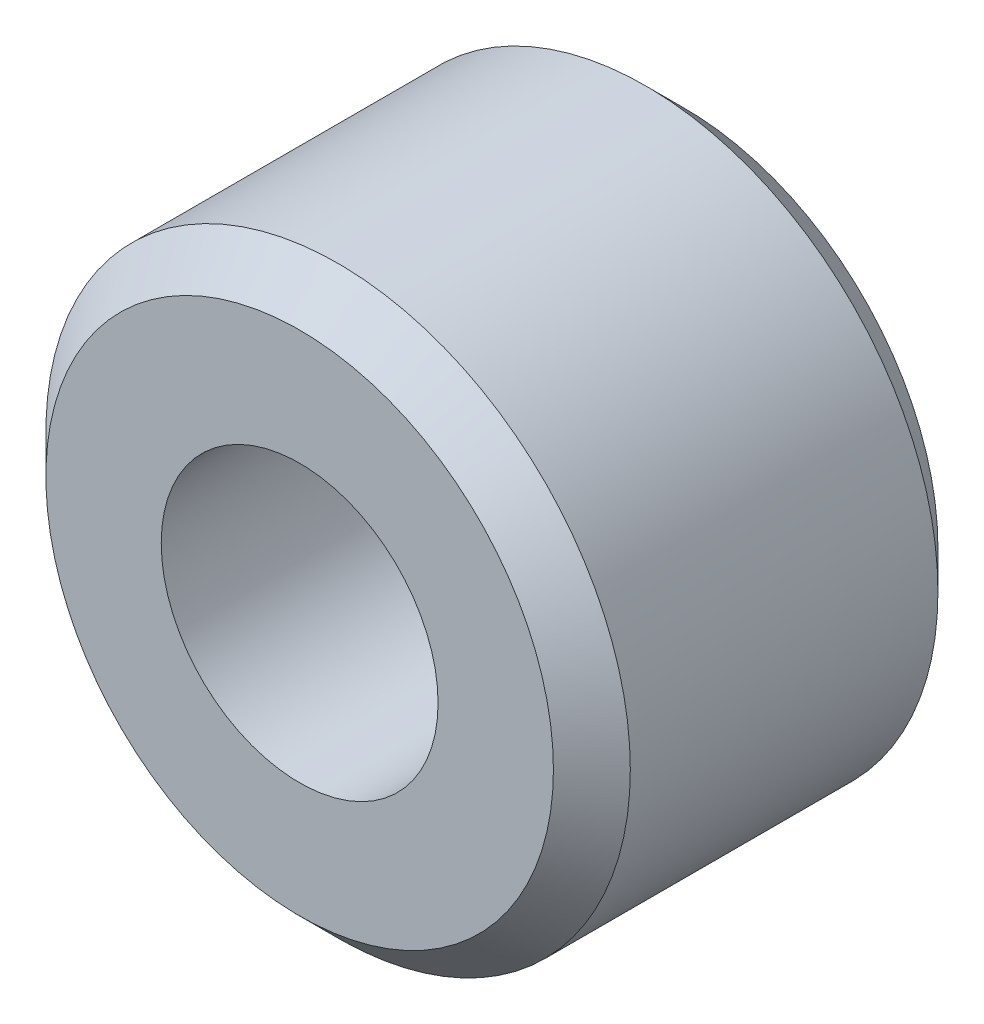
ISO-10303-21;
HEADER;
FILE_DESCRIPTION(('STEP AP214'),'2;1');
FILE_NAME('part.step','',(''),(''),'','','');
FILE_SCHEMA(('AUTOMOTIVE_DESIGN { 1 0 10303 214 1 1 1 1 }'));
ENDSEC;
DATA;
#1=APPLICATION_CONTEXT('core data for automotive mechanical design processes');
#2=APPLICATION_PROTOCOL_DEFINITION('international standard','automotive_design',2000,#1);
#3=PRODUCT_CONTEXT('',#1,'mechanical');
#4=PRODUCT('Part','Part','',(#3));
#5=PRODUCT_RELATED_PRODUCT_CATEGORY('part','',(#4));
#6=PRODUCT_DEFINITION_FORMATION('','',#4);
#7=PRODUCT_DEFINITION_CONTEXT('part definition',#1,'design');
#8=PRODUCT_DEFINITION('design','',#6,#7);
#9=PRODUCT_DEFINITION_SHAPE('','',#8);
#10=(LENGTH_UNIT() NAMED_UNIT(*) SI_UNIT(.MILLI.,.METRE.));
#11=(NAMED_UNIT(*) PLANE_ANGLE_UNIT() SI_UNIT($,.RADIAN.));
#12=(NAMED_UNIT(*) SI_UNIT($,.STERADIAN.) SOLID_ANGLE_UNIT());
#13=UNCERTAINTY_MEASURE_WITH_UNIT(LENGTH_MEASURE(1.E-05),#10,'distance_accuracy_value','');
#14=(GEOMETRIC_REPRESENTATION_CONTEXT(3) GLOBAL_UNCERTAINTY_ASSIGNED_CONTEXT((#13)) GLOBAL_UNIT_ASSIGNED_CONTEXT((#10,
#11,#12)) REPRESENTATION_CONTEXT('',''));
#15=CARTESIAN_POINT('',(0.,0.,0.));
#16=DIRECTION('',(0.,0.,1.));
#17=DIRECTION('',(1.,0.,0.));
#18=AXIS2_PLACEMENT_3D('',#15,#16,#17);
#19=CARTESIAN_POINT('',(0.,0.,5.));
#20=DIRECTION('',(0.,0.,1.));
#21=DIRECTION('',(1.,0.,0.));
#22=AXIS2_PLACEMENT_3D('',#19,#20,#21);
#23=PLANE('',#22);
#24=CARTESIAN_POINT('',(0.,0.,5.));
#25=DIRECTION('',(0.,0.,1.));
#26=DIRECTION('',(1.,0.,0.));
#27=AXIS2_PLACEMENT_3D('',#24,#25,#26);
#28=CIRCLE('',#27,3.3);
#29=CARTESIAN_POINT('',(3.3,0.,5.));
#30=VERTEX_POINT('',#29);
#31=EDGE_CURVE('E10',#30,#30,#28,.T.);
#32=ORIENTED_EDGE('',*,*,#31,.T.);
#33=EDGE_LOOP('',(#32));
#34=FACE_BOUND('',#33,.T.);
#35=CARTESIAN_POINT('',(0.,0.,5.));
#36=DIRECTION('',(0.,0.,1.));
#37=DIRECTION('',(1.,0.,0.));
#38=AXIS2_PLACEMENT_3D('',#35,#36,#37);
#39=CIRCLE('',#38,1.8);
#40=CARTESIAN_POINT('',(1.8,0.,5.));
#41=VERTEX_POINT('',#40);
#42=EDGE_CURVE('E66',#41,#41,#39,.T.);
#43=ORIENTED_EDGE('',*,*,#42,.F.);
#44=EDGE_LOOP('',(#43));
#45=FACE_BOUND('',#44,.T.);
#46=ADVANCED_FACE('F40',(#34,#45),#23,.T.);
#47=CARTESIAN_POINT('',(0.,0.,0.));
#48=DIRECTION('',(0.,0.,1.));
#49=DIRECTION('',(1.,0.,0.));
#50=AXIS2_PLACEMENT_3D('',#47,#48,#49);
#51=PLANE('',#50);
#52=CARTESIAN_POINT('',(0.,0.,0.));
#53=DIRECTION('',(0.,0.,1.));
#54=DIRECTION('',(1.,0.,0.));
#55=AXIS2_PLACEMENT_3D('',#52,#53,#54);
#56=CIRCLE('',#55,3.3);
#57=CARTESIAN_POINT('',(3.3,0.,0.));
#58=VERTEX_POINT('',#57);
#59=EDGE_CURVE('E49',#58,#58,#56,.F.);
#60=ORIENTED_EDGE('',*,*,#59,.T.);
#61=EDGE_LOOP('',(#60));
#62=FACE_BOUND('',#61,.T.);
#63=CARTESIAN_POINT('',(0.,0.,0.));
#64=DIRECTION('',(0.,0.,1.));
#65=DIRECTION('',(1.,0.,0.));
#66=AXIS2_PLACEMENT_3D('',#63,#64,#65);
#67=CIRCLE('',#66,1.8);
#68=CARTESIAN_POINT('',(1.8,0.,0.));
#69=VERTEX_POINT('',#68);
#70=EDGE_CURVE('E67',#69,#69,#67,.T.);
#71=ORIENTED_EDGE('',*,*,#70,.T.);
#72=EDGE_LOOP('',(#71));
#73=FACE_BOUND('',#72,.T.);
#74=ADVANCED_FACE('F78',(#62,#73),#51,.F.);
#75=CARTESIAN_POINT('',(0.,0.,5.));
#76=DIRECTION('',(0.,0.,-1.));
#77=DIRECTION('',(-1.,0.,0.));
#78=AXIS2_PLACEMENT_3D('',#75,#76,#77);
#79=CYLINDRICAL_SURFACE('',#78,3.8);
#80=CARTESIAN_POINT('',(0.,0.,0.500000000000001));
#81=DIRECTION('',(0.,0.,1.));
#82=DIRECTION('',(1.,0.,0.));
#83=AXIS2_PLACEMENT_3D('',#80,#81,#82);
#84=CIRCLE('',#83,3.8);
#85=CARTESIAN_POINT('',(3.8,0.,0.500000000000001));
#86=VERTEX_POINT('',#85);
#87=EDGE_CURVE('E55',#86,#86,#84,.T.);
#88=ORIENTED_EDGE('',*,*,#87,.T.);
#89=EDGE_LOOP('',(#88));
#90=FACE_BOUND('',#89,.T.);
#91=CARTESIAN_POINT('',(0.,0.,4.5));
#92=DIRECTION('',(0.,0.,1.));
#93=DIRECTION('',(1.,0.,0.));
#94=AXIS2_PLACEMENT_3D('',#91,#92,#93);
#95=CIRCLE('',#94,3.8);
#96=CARTESIAN_POINT('',(3.8,0.,4.5));
#97=VERTEX_POINT('',#96);
#98=EDGE_CURVE('E61',#97,#97,#95,.F.);
#99=ORIENTED_EDGE('',*,*,#98,.T.);
#100=EDGE_LOOP('',(#99));
#101=FACE_BOUND('',#100,.T.);
#102=ADVANCED_FACE('F83',(#90,#101),#79,.T.);
#103=CARTESIAN_POINT('',(0.,0.,5.));
#104=DIRECTION('',(0.,0.,-1.));
#105=DIRECTION('',(-1.,0.,0.));
#106=AXIS2_PLACEMENT_3D('',#103,#104,#105);
#107=CYLINDRICAL_SURFACE('',#106,1.8);
#108=ORIENTED_EDGE('',*,*,#42,.T.);
#109=EDGE_LOOP('',(#108));
#110=FACE_BOUND('',#109,.T.);
#111=ORIENTED_EDGE('',*,*,#70,.F.);
#112=EDGE_LOOP('',(#111));
#113=FACE_BOUND('',#112,.T.);
#114=ADVANCED_FACE('F74',(#110,#113),#107,.F.);
#115=CARTESIAN_POINT('',(0.,0.,0.500000000000001));
#116=DIRECTION('',(0.,0.,1.));
#117=DIRECTION('',(1.,0.,0.));
#118=AXIS2_PLACEMENT_3D('',#115,#116,#117);
#119=CONICAL_SURFACE('',#118,3.8,0.785398163397451);
#120=ORIENTED_EDGE('',*,*,#59,.F.);
#121=EDGE_LOOP('',(#120));
#122=FACE_BOUND('',#121,.T.);
#123=ORIENTED_EDGE('',*,*,#87,.F.);
#124=EDGE_LOOP('',(#123));
#125=FACE_BOUND('',#124,.T.);
#126=ADVANCED_FACE('F90',(#122,#125),#119,.T.);
#127=CARTESIAN_POINT('',(0.,0.,5.));
#128=DIRECTION('',(0.,0.,-1.));
#129=DIRECTION('',(-1.,0.,0.));
#130=AXIS2_PLACEMENT_3D('',#127,#128,#129);
#131=CONICAL_SURFACE('',#130,3.3,0.785398163397447);
#132=ORIENTED_EDGE('',*,*,#98,.F.);
#133=EDGE_LOOP('',(#132));
#134=FACE_BOUND('',#133,.T.);
#135=ORIENTED_EDGE('',*,*,#31,.F.);
#136=EDGE_LOOP('',(#135));
#137=FACE_BOUND('',#136,.T.);
#138=ADVANCED_FACE('F43',(#134,#137),#131,.T.);
#139=CLOSED_SHELL('',(#46,#74,#102,#114,#126,#138));
#140=MANIFOLD_SOLID_BREP('B2',#139);
#141=ADVANCED_BREP_SHAPE_REPRESENTATION('',(#18,#140),#14);
#142=SHAPE_DEFINITION_REPRESENTATION(#9,#141);
ENDSEC;
END-ISO-10303-21;
